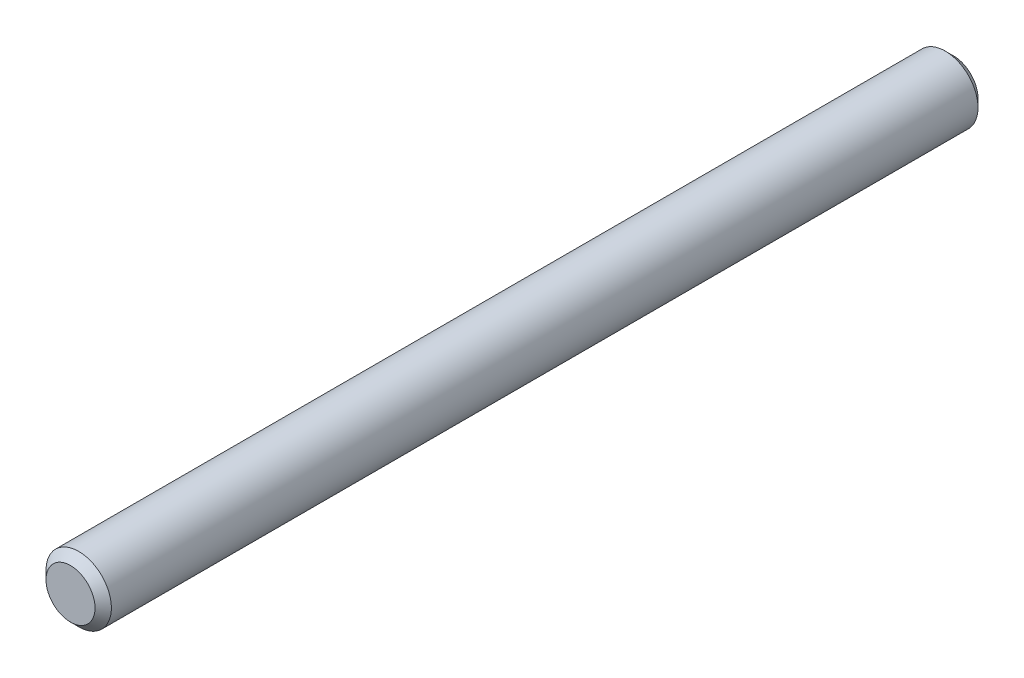
ISO-10303-21;
HEADER;
FILE_DESCRIPTION(('STEP AP214'),'2;1');
FILE_NAME('part.step','',(''),(''),'','','');
FILE_SCHEMA(('AUTOMOTIVE_DESIGN { 1 0 10303 214 1 1 1 1 }'));
ENDSEC;
DATA;
#1=APPLICATION_CONTEXT('core data for automotive mechanical design processes');
#2=APPLICATION_PROTOCOL_DEFINITION('international standard','automotive_design',2000,#1);
#3=PRODUCT_CONTEXT('',#1,'mechanical');
#4=PRODUCT('Part','Part','',(#3));
#5=PRODUCT_RELATED_PRODUCT_CATEGORY('part','',(#4));
#6=PRODUCT_DEFINITION_FORMATION('','',#4);
#7=PRODUCT_DEFINITION_CONTEXT('part definition',#1,'design');
#8=PRODUCT_DEFINITION('design','',#6,#7);
#9=PRODUCT_DEFINITION_SHAPE('','',#8);
#10=(LENGTH_UNIT() NAMED_UNIT(*) SI_UNIT(.MILLI.,.METRE.));
#11=(NAMED_UNIT(*) PLANE_ANGLE_UNIT() SI_UNIT($,.RADIAN.));
#12=(NAMED_UNIT(*) SI_UNIT($,.STERADIAN.) SOLID_ANGLE_UNIT());
#13=UNCERTAINTY_MEASURE_WITH_UNIT(LENGTH_MEASURE(1.E-05),#10,'distance_accuracy_value','');
#14=(GEOMETRIC_REPRESENTATION_CONTEXT(3) GLOBAL_UNCERTAINTY_ASSIGNED_CONTEXT((#13)) GLOBAL_UNIT_ASSIGNED_CONTEXT((#10,
#11,#12)) REPRESENTATION_CONTEXT('',''));
#15=CARTESIAN_POINT('',(0.,0.,0.));
#16=DIRECTION('',(0.,0.,1.));
#17=DIRECTION('',(1.,0.,0.));
#18=AXIS2_PLACEMENT_3D('',#15,#16,#17);
#19=CARTESIAN_POINT('',(0.,0.,27.));
#20=DIRECTION('',(0.,0.,-1.));
#21=DIRECTION('',(-1.,0.,0.));
#22=AXIS2_PLACEMENT_3D('',#19,#20,#21);
#23=CYLINDRICAL_SURFACE('',#22,1.);
#24=CARTESIAN_POINT('',(0.,0.,0.25));
#25=DIRECTION('',(0.,0.,1.));
#26=DIRECTION('',(1.,0.,0.));
#27=AXIS2_PLACEMENT_3D('',#24,#25,#26);
#28=CIRCLE('',#27,1.);
#29=CARTESIAN_POINT('',(1.,0.,0.25));
#30=VERTEX_POINT('',#29);
#31=EDGE_CURVE('E39',#30,#30,#28,.T.);
#32=ORIENTED_EDGE('',*,*,#31,.T.);
#33=EDGE_LOOP('',(#32));
#34=FACE_BOUND('',#33,.T.);
#35=CARTESIAN_POINT('',(0.,0.,26.75));
#36=DIRECTION('',(0.,0.,1.));
#37=DIRECTION('',(1.,0.,0.));
#38=AXIS2_PLACEMENT_3D('',#35,#36,#37);
#39=CIRCLE('',#38,1.);
#40=CARTESIAN_POINT('',(1.,0.,26.75));
#41=VERTEX_POINT('',#40);
#42=EDGE_CURVE('E43',#41,#41,#39,.F.);
#43=ORIENTED_EDGE('',*,*,#42,.T.);
#44=EDGE_LOOP('',(#43));
#45=FACE_BOUND('',#44,.T.);
#46=ADVANCED_FACE('F29',(#34,#45),#23,.T.);
#47=CARTESIAN_POINT('',(0.,0.,27.));
#48=DIRECTION('',(0.,0.,1.));
#49=DIRECTION('',(1.,0.,0.));
#50=AXIS2_PLACEMENT_3D('',#47,#48,#49);
#51=PLANE('',#50);
#52=CARTESIAN_POINT('',(0.,0.,27.));
#53=DIRECTION('',(0.,0.,1.));
#54=DIRECTION('',(1.,0.,0.));
#55=AXIS2_PLACEMENT_3D('',#52,#53,#54);
#56=CIRCLE('',#55,0.749999999999996);
#57=CARTESIAN_POINT('',(0.749999999999996,0.,27.));
#58=VERTEX_POINT('',#57);
#59=EDGE_CURVE('E10',#58,#58,#56,.T.);
#60=ORIENTED_EDGE('',*,*,#59,.T.);
#61=EDGE_LOOP('',(#60));
#62=FACE_BOUND('',#61,.T.);
#63=ADVANCED_FACE('F62',(#62),#51,.T.);
#64=CARTESIAN_POINT('',(0.,0.,0.));
#65=DIRECTION('',(0.,0.,1.));
#66=DIRECTION('',(1.,0.,0.));
#67=AXIS2_PLACEMENT_3D('',#64,#65,#66);
#68=PLANE('',#67);
#69=CARTESIAN_POINT('',(0.,0.,0.));
#70=DIRECTION('',(0.,0.,1.));
#71=DIRECTION('',(1.,0.,0.));
#72=AXIS2_PLACEMENT_3D('',#69,#70,#71);
#73=CIRCLE('',#72,0.749999999999996);
#74=CARTESIAN_POINT('',(0.749999999999996,0.,0.));
#75=VERTEX_POINT('',#74);
#76=EDGE_CURVE('E35',#75,#75,#73,.F.);
#77=ORIENTED_EDGE('',*,*,#76,.T.);
#78=EDGE_LOOP('',(#77));
#79=FACE_BOUND('',#78,.T.);
#80=ADVANCED_FACE('F58',(#79),#68,.F.);
#81=CARTESIAN_POINT('',(0.,0.,0.25));
#82=DIRECTION('',(0.,0.,1.));
#83=DIRECTION('',(1.,0.,0.));
#84=AXIS2_PLACEMENT_3D('',#81,#82,#83);
#85=CONICAL_SURFACE('',#84,1.,0.785398163397457);
#86=ORIENTED_EDGE('',*,*,#76,.F.);
#87=EDGE_LOOP('',(#86));
#88=FACE_BOUND('',#87,.T.);
#89=ORIENTED_EDGE('',*,*,#31,.F.);
#90=EDGE_LOOP('',(#89));
#91=FACE_BOUND('',#90,.T.);
#92=ADVANCED_FACE('F53',(#88,#91),#85,.T.);
#93=CARTESIAN_POINT('',(0.,0.,27.));
#94=DIRECTION('',(0.,0.,-1.));
#95=DIRECTION('',(-1.,0.,0.));
#96=AXIS2_PLACEMENT_3D('',#93,#94,#95);
#97=CONICAL_SURFACE('',#96,0.749999999999996,0.785398163397457);
#98=ORIENTED_EDGE('',*,*,#42,.F.);
#99=EDGE_LOOP('',(#98));
#100=FACE_BOUND('',#99,.T.);
#101=ORIENTED_EDGE('',*,*,#59,.F.);
#102=EDGE_LOOP('',(#101));
#103=FACE_BOUND('',#102,.T.);
#104=ADVANCED_FACE('F50',(#100,#103),#97,.T.);
#105=CLOSED_SHELL('',(#46,#63,#80,#92,#104));
#106=MANIFOLD_SOLID_BREP('B2',#105);
#107=ADVANCED_BREP_SHAPE_REPRESENTATION('',(#18,#106),#14);
#108=SHAPE_DEFINITION_REPRESENTATION(#9,#107);
ENDSEC;
END-ISO-10303-21;
